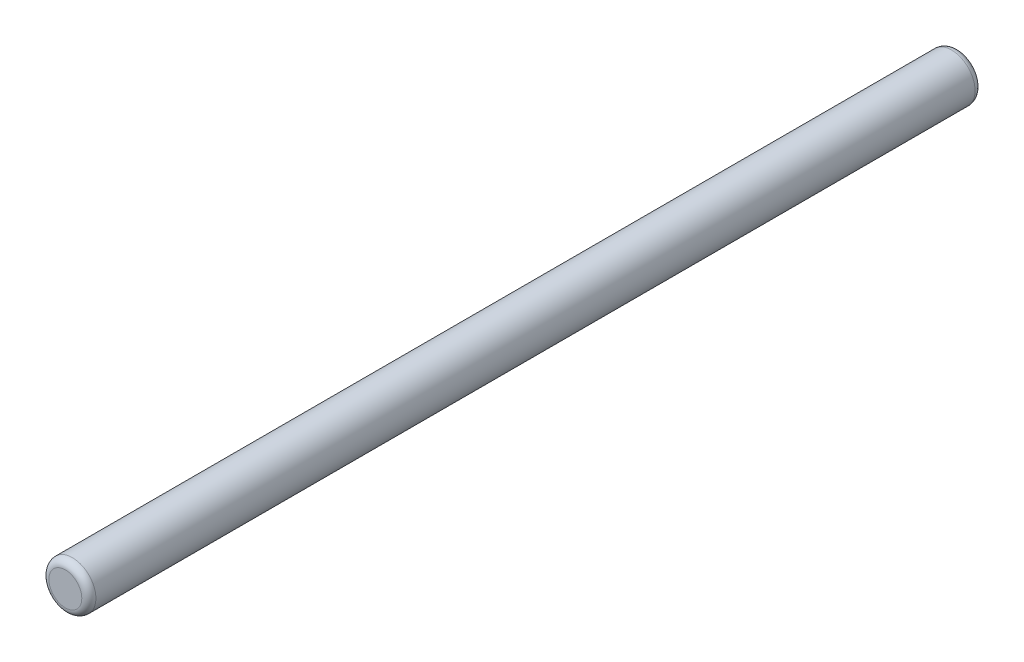
ISO-10303-21;
HEADER;
FILE_DESCRIPTION(('STEP AP214'),'2;1');
FILE_NAME('part.step','',(''),(''),'','','');
FILE_SCHEMA(('AUTOMOTIVE_DESIGN { 1 0 10303 214 1 1 1 1 }'));
ENDSEC;
DATA;
#1=APPLICATION_CONTEXT('core data for automotive mechanical design processes');
#2=APPLICATION_PROTOCOL_DEFINITION('international standard','automotive_design',2000,#1);
#3=PRODUCT_CONTEXT('',#1,'mechanical');
#4=PRODUCT('Part','Part','',(#3));
#5=PRODUCT_RELATED_PRODUCT_CATEGORY('part','',(#4));
#6=PRODUCT_DEFINITION_FORMATION('','',#4);
#7=PRODUCT_DEFINITION_CONTEXT('part definition',#1,'design');
#8=PRODUCT_DEFINITION('design','',#6,#7);
#9=PRODUCT_DEFINITION_SHAPE('','',#8);
#10=(LENGTH_UNIT() NAMED_UNIT(*) SI_UNIT(.MILLI.,.METRE.));
#11=(NAMED_UNIT(*) PLANE_ANGLE_UNIT() SI_UNIT($,.RADIAN.));
#12=(NAMED_UNIT(*) SI_UNIT($,.STERADIAN.) SOLID_ANGLE_UNIT());
#13=UNCERTAINTY_MEASURE_WITH_UNIT(LENGTH_MEASURE(1.E-05),#10,'distance_accuracy_value','');
#14=(GEOMETRIC_REPRESENTATION_CONTEXT(3) GLOBAL_UNCERTAINTY_ASSIGNED_CONTEXT((#13)) GLOBAL_UNIT_ASSIGNED_CONTEXT((#10,
#11,#12)) REPRESENTATION_CONTEXT('',''));
#15=CARTESIAN_POINT('',(0.,0.,0.));
#16=DIRECTION('',(0.,0.,1.));
#17=DIRECTION('',(1.,0.,0.));
#18=AXIS2_PLACEMENT_3D('',#15,#16,#17);
#19=CARTESIAN_POINT('',(0.,0.,38.));
#20=DIRECTION('',(0.,0.,-1.));
#21=DIRECTION('',(-1.,0.,0.));
#22=AXIS2_PLACEMENT_3D('',#19,#20,#21);
#23=CYLINDRICAL_SURFACE('',#22,1.);
#24=CARTESIAN_POINT('',(0.,0.,0.299999999999918));
#25=DIRECTION('',(0.,0.,1.));
#26=DIRECTION('',(1.,0.,0.));
#27=AXIS2_PLACEMENT_3D('',#24,#25,#26);
#28=CIRCLE('',#27,1.);
#29=CARTESIAN_POINT('',(1.,0.,0.299999999999918));
#30=VERTEX_POINT('',#29);
#31=EDGE_CURVE('E36',#30,#30,#28,.T.);
#32=ORIENTED_EDGE('',*,*,#31,.T.);
#33=EDGE_LOOP('',(#32));
#34=FACE_BOUND('',#33,.T.);
#35=CARTESIAN_POINT('',(0.,0.,37.7));
#36=DIRECTION('',(0.,0.,1.));
#37=DIRECTION('',(1.,0.,0.));
#38=AXIS2_PLACEMENT_3D('',#35,#36,#37);
#39=CIRCLE('',#38,1.);
#40=CARTESIAN_POINT('',(1.,0.,37.7));
#41=VERTEX_POINT('',#40);
#42=EDGE_CURVE('E40',#41,#41,#39,.F.);
#43=ORIENTED_EDGE('',*,*,#42,.T.);
#44=EDGE_LOOP('',(#43));
#45=FACE_BOUND('',#44,.T.);
#46=ADVANCED_FACE('F26',(#34,#45),#23,.T.);
#47=CARTESIAN_POINT('',(0.,0.,38.));
#48=DIRECTION('',(0.,0.,1.));
#49=DIRECTION('',(1.,0.,0.));
#50=AXIS2_PLACEMENT_3D('',#47,#48,#49);
#51=PLANE('',#50);
#52=CARTESIAN_POINT('',(0.,0.,38.));
#53=DIRECTION('',(0.,0.,1.));
#54=DIRECTION('',(1.,0.,0.));
#55=AXIS2_PLACEMENT_3D('',#52,#53,#54);
#56=CIRCLE('',#55,0.7);
#57=CARTESIAN_POINT('',(0.700000000000004,0.,38.));
#58=VERTEX_POINT('',#57);
#59=EDGE_CURVE('E10',#58,#58,#56,.T.);
#60=ORIENTED_EDGE('',*,*,#59,.T.);
#61=EDGE_LOOP('',(#60));
#62=FACE_BOUND('',#61,.T.);
#63=ADVANCED_FACE('F59',(#62),#51,.T.);
#64=CARTESIAN_POINT('',(0.,0.,0.));
#65=DIRECTION('',(0.,0.,1.));
#66=DIRECTION('',(1.,0.,0.));
#67=AXIS2_PLACEMENT_3D('',#64,#65,#66);
#68=PLANE('',#67);
#69=CARTESIAN_POINT('',(0.,0.,0.));
#70=DIRECTION('',(0.,0.,1.));
#71=DIRECTION('',(1.,0.,0.));
#72=AXIS2_PLACEMENT_3D('',#69,#70,#71);
#73=CIRCLE('',#72,0.7);
#74=CARTESIAN_POINT('',(0.7,0.,0.));
#75=VERTEX_POINT('',#74);
#76=EDGE_CURVE('E32',#75,#75,#73,.F.);
#77=ORIENTED_EDGE('',*,*,#76,.T.);
#78=EDGE_LOOP('',(#77));
#79=FACE_BOUND('',#78,.T.);
#80=ADVANCED_FACE('F55',(#79),#68,.F.);
#81=CARTESIAN_POINT('',(0.,0.,0.299999999999918));
#82=DIRECTION('',(0.,0.,1.));
#83=DIRECTION('',(1.,0.,0.));
#84=AXIS2_PLACEMENT_3D('',#81,#82,#83);
#85=TOROIDAL_SURFACE('',#84,0.7,0.3);
#86=ORIENTED_EDGE('',*,*,#76,.F.);
#87=EDGE_LOOP('',(#86));
#88=FACE_BOUND('',#87,.T.);
#89=ORIENTED_EDGE('',*,*,#31,.F.);
#90=EDGE_LOOP('',(#89));
#91=FACE_BOUND('',#90,.T.);
#92=ADVANCED_FACE('F50',(#88,#91),#85,.T.);
#93=CARTESIAN_POINT('',(0.,0.,37.7));
#94=DIRECTION('',(0.,0.,1.));
#95=DIRECTION('',(1.,0.,0.));
#96=AXIS2_PLACEMENT_3D('',#93,#94,#95);
#97=TOROIDAL_SURFACE('',#96,0.7,0.3);
#98=ORIENTED_EDGE('',*,*,#42,.F.);
#99=EDGE_LOOP('',(#98));
#100=FACE_BOUND('',#99,.T.);
#101=ORIENTED_EDGE('',*,*,#59,.F.);
#102=EDGE_LOOP('',(#101));
#103=FACE_BOUND('',#102,.T.);
#104=ADVANCED_FACE('F47',(#100,#103),#97,.T.);
#105=CLOSED_SHELL('',(#46,#63,#80,#92,#104));
#106=MANIFOLD_SOLID_BREP('B2',#105);
#107=ADVANCED_BREP_SHAPE_REPRESENTATION('',(#18,#106),#14);
#108=SHAPE_DEFINITION_REPRESENTATION(#9,#107);
ENDSEC;
END-ISO-10303-21;
